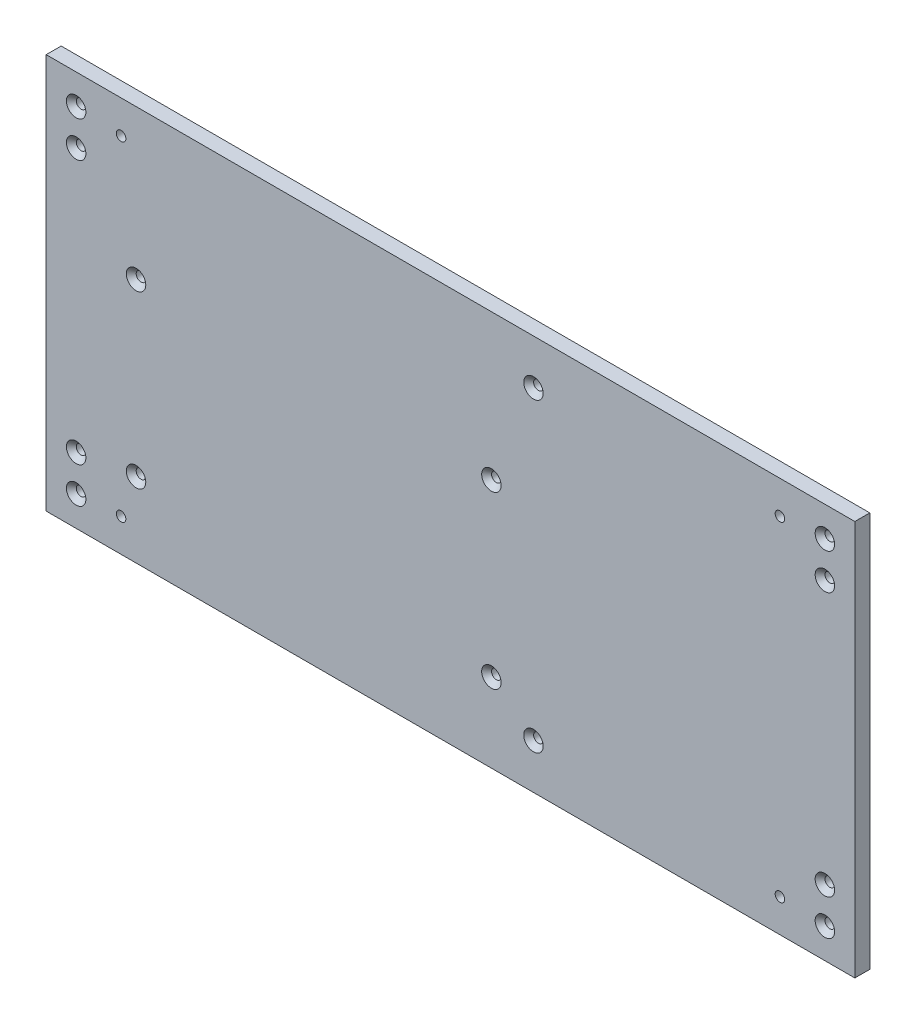
ISO-10303-21;
HEADER;
FILE_DESCRIPTION(('STEP AP214'),'2;1');
FILE_NAME('part.step','',(''),(''),'','','');
FILE_SCHEMA(('AUTOMOTIVE_DESIGN { 1 0 10303 214 1 1 1 1 }'));
ENDSEC;
DATA;
#1=APPLICATION_CONTEXT('core data for automotive mechanical design processes');
#2=APPLICATION_PROTOCOL_DEFINITION('international standard','automotive_design',2000,#1);
#3=PRODUCT_CONTEXT('',#1,'mechanical');
#4=PRODUCT('Part','Part','',(#3));
#5=PRODUCT_RELATED_PRODUCT_CATEGORY('part','',(#4));
#6=PRODUCT_DEFINITION_FORMATION('','',#4);
#7=PRODUCT_DEFINITION_CONTEXT('part definition',#1,'design');
#8=PRODUCT_DEFINITION('design','',#6,#7);
#9=PRODUCT_DEFINITION_SHAPE('','',#8);
#10=(LENGTH_UNIT() NAMED_UNIT(*) SI_UNIT(.MILLI.,.METRE.));
#11=(NAMED_UNIT(*) PLANE_ANGLE_UNIT() SI_UNIT($,.RADIAN.));
#12=(NAMED_UNIT(*) SI_UNIT($,.STERADIAN.) SOLID_ANGLE_UNIT());
#13=UNCERTAINTY_MEASURE_WITH_UNIT(LENGTH_MEASURE(1.E-05),#10,'distance_accuracy_value','');
#14=(GEOMETRIC_REPRESENTATION_CONTEXT(3) GLOBAL_UNCERTAINTY_ASSIGNED_CONTEXT((#13)) GLOBAL_UNIT_ASSIGNED_CONTEXT((#10,
#11,#12)) REPRESENTATION_CONTEXT('',''));
#15=CARTESIAN_POINT('',(0.,0.,0.));
#16=DIRECTION('',(0.,0.,1.));
#17=DIRECTION('',(1.,0.,0.));
#18=AXIS2_PLACEMENT_3D('',#15,#16,#17);
#19=CARTESIAN_POINT('',(-135.,0.,2.5));
#20=DIRECTION('',(-1.,0.,0.));
#21=DIRECTION('',(0.,0.,1.));
#22=AXIS2_PLACEMENT_3D('',#19,#20,#21);
#23=PLANE('',#22);
#24=DIRECTION('',(0.,1.,0.));
#25=VECTOR('',#24,1.);
#26=CARTESIAN_POINT('',(-135.,0.,-2.5));
#27=LINE('',#26,#25);
#28=CARTESIAN_POINT('',(-135.,-66.,-2.5));
#29=VERTEX_POINT('',#28);
#30=CARTESIAN_POINT('',(-135.,66.,-2.5));
#31=VERTEX_POINT('',#30);
#32=EDGE_CURVE('E99',#29,#31,#27,.T.);
#33=ORIENTED_EDGE('',*,*,#32,.F.);
#34=DIRECTION('',(0.,0.,-1.));
#35=VECTOR('',#34,1.);
#36=CARTESIAN_POINT('',(-135.,-66.,2.5));
#37=LINE('',#36,#35);
#38=CARTESIAN_POINT('',(-135.,-66.,2.5));
#39=VERTEX_POINT('',#38);
#40=EDGE_CURVE('E11',#39,#29,#37,.T.);
#41=ORIENTED_EDGE('',*,*,#40,.F.);
#42=DIRECTION('',(0.,1.,0.));
#43=VECTOR('',#42,1.);
#44=CARTESIAN_POINT('',(-135.,0.,2.5));
#45=LINE('',#44,#43);
#46=CARTESIAN_POINT('',(-135.,66.,2.5));
#47=VERTEX_POINT('',#46);
#48=EDGE_CURVE('E92',#39,#47,#45,.T.);
#49=ORIENTED_EDGE('',*,*,#48,.T.);
#50=DIRECTION('',(0.,0.,-1.));
#51=VECTOR('',#50,1.);
#52=CARTESIAN_POINT('',(-135.,66.,2.5));
#53=LINE('',#52,#51);
#54=EDGE_CURVE('E73',#47,#31,#53,.T.);
#55=ORIENTED_EDGE('',*,*,#54,.T.);
#56=EDGE_LOOP('',(#33,#41,#49,#55));
#57=FACE_BOUND('',#56,.T.);
#58=ADVANCED_FACE('F35',(#57),#23,.T.);
#59=CARTESIAN_POINT('',(0.,-66.,2.5));
#60=DIRECTION('',(0.,-1.,0.));
#61=DIRECTION('',(1.,0.,0.));
#62=AXIS2_PLACEMENT_3D('',#59,#60,#61);
#63=PLANE('',#62);
#64=DIRECTION('',(-1.,0.,0.));
#65=VECTOR('',#64,1.);
#66=CARTESIAN_POINT('',(0.,-66.,-2.5));
#67=LINE('',#66,#65);
#68=CARTESIAN_POINT('',(135.,-66.,-2.5));
#69=VERTEX_POINT('',#68);
#70=EDGE_CURVE('E86',#69,#29,#67,.T.);
#71=ORIENTED_EDGE('',*,*,#70,.F.);
#72=DIRECTION('',(0.,0.,-1.));
#73=VECTOR('',#72,1.);
#74=CARTESIAN_POINT('',(135.,-66.,2.5));
#75=LINE('',#74,#73);
#76=CARTESIAN_POINT('',(135.,-66.,2.5));
#77=VERTEX_POINT('',#76);
#78=EDGE_CURVE('E43',#77,#69,#75,.T.);
#79=ORIENTED_EDGE('',*,*,#78,.F.);
#80=DIRECTION('',(-1.,0.,0.));
#81=VECTOR('',#80,1.);
#82=CARTESIAN_POINT('',(0.,-66.,2.5));
#83=LINE('',#82,#81);
#84=EDGE_CURVE('E84',#77,#39,#83,.T.);
#85=ORIENTED_EDGE('',*,*,#84,.T.);
#86=ORIENTED_EDGE('',*,*,#40,.T.);
#87=EDGE_LOOP('',(#71,#79,#85,#86));
#88=FACE_BOUND('',#87,.T.);
#89=ADVANCED_FACE('F82',(#88),#63,.T.);
#90=CARTESIAN_POINT('',(135.,0.,2.5));
#91=DIRECTION('',(-1.,0.,0.));
#92=DIRECTION('',(0.,0.,1.));
#93=AXIS2_PLACEMENT_3D('',#90,#91,#92);
#94=PLANE('',#93);
#95=DIRECTION('',(0.,1.,0.));
#96=VECTOR('',#95,1.);
#97=CARTESIAN_POINT('',(135.,0.,-2.5));
#98=LINE('',#97,#96);
#99=CARTESIAN_POINT('',(135.,66.,-2.5));
#100=VERTEX_POINT('',#99);
#101=EDGE_CURVE('E66',#69,#100,#98,.T.);
#102=ORIENTED_EDGE('',*,*,#101,.T.);
#103=DIRECTION('',(0.,0.,-1.));
#104=VECTOR('',#103,1.);
#105=CARTESIAN_POINT('',(135.,66.,2.5));
#106=LINE('',#105,#104);
#107=CARTESIAN_POINT('',(135.,66.,2.5));
#108=VERTEX_POINT('',#107);
#109=EDGE_CURVE('E87',#108,#100,#106,.T.);
#110=ORIENTED_EDGE('',*,*,#109,.F.);
#111=DIRECTION('',(0.,1.,0.));
#112=VECTOR('',#111,1.);
#113=CARTESIAN_POINT('',(135.,0.,2.5));
#114=LINE('',#113,#112);
#115=EDGE_CURVE('E88',#77,#108,#114,.T.);
#116=ORIENTED_EDGE('',*,*,#115,.F.);
#117=ORIENTED_EDGE('',*,*,#78,.T.);
#118=EDGE_LOOP('',(#102,#110,#116,#117));
#119=FACE_BOUND('',#118,.T.);
#120=ADVANCED_FACE('F89',(#119),#94,.F.);
#121=CARTESIAN_POINT('',(0.,66.,2.5));
#122=DIRECTION('',(0.,-1.,0.));
#123=DIRECTION('',(1.,0.,0.));
#124=AXIS2_PLACEMENT_3D('',#121,#122,#123);
#125=PLANE('',#124);
#126=DIRECTION('',(-1.,0.,0.));
#127=VECTOR('',#126,1.);
#128=CARTESIAN_POINT('',(0.,66.,-2.5));
#129=LINE('',#128,#127);
#130=EDGE_CURVE('E94',#100,#31,#129,.T.);
#131=ORIENTED_EDGE('',*,*,#130,.T.);
#132=ORIENTED_EDGE('',*,*,#54,.F.);
#133=DIRECTION('',(-1.,0.,0.));
#134=VECTOR('',#133,1.);
#135=CARTESIAN_POINT('',(0.,66.,2.5));
#136=LINE('',#135,#134);
#137=EDGE_CURVE('E51',#108,#47,#136,.T.);
#138=ORIENTED_EDGE('',*,*,#137,.F.);
#139=ORIENTED_EDGE('',*,*,#109,.T.);
#140=EDGE_LOOP('',(#131,#132,#138,#139));
#141=FACE_BOUND('',#140,.T.);
#142=ADVANCED_FACE('F109',(#141),#125,.F.);
#143=CARTESIAN_POINT('',(0.,0.,2.5));
#144=DIRECTION('',(0.,0.,1.));
#145=DIRECTION('',(1.,0.,0.));
#146=AXIS2_PLACEMENT_3D('',#143,#144,#145);
#147=PLANE('',#146);
#148=CARTESIAN_POINT('',(13.65,-39.65,2.5));
#149=DIRECTION('',(0.,0.,1.));
#150=DIRECTION('',(1.,0.,0.));
#151=AXIS2_PLACEMENT_3D('',#148,#149,#150);
#152=CIRCLE('',#151,3.25);
#153=CARTESIAN_POINT('',(16.9,-39.65,2.5));
#154=VERTEX_POINT('',#153);
#155=EDGE_CURVE('E264',#154,#154,#152,.T.);
#156=ORIENTED_EDGE('',*,*,#155,.F.);
#157=EDGE_LOOP('',(#156));
#158=FACE_BOUND('',#157,.T.);
#159=CARTESIAN_POINT('',(-105.,16.,2.5));
#160=DIRECTION('',(0.,0.,1.));
#161=DIRECTION('',(1.,0.,0.));
#162=AXIS2_PLACEMENT_3D('',#159,#160,#161);
#163=CIRCLE('',#162,3.25);
#164=CARTESIAN_POINT('',(-101.75,16.,2.5));
#165=VERTEX_POINT('',#164);
#166=EDGE_CURVE('E271',#165,#165,#163,.T.);
#167=ORIENTED_EDGE('',*,*,#166,.F.);
#168=EDGE_LOOP('',(#167));
#169=FACE_BOUND('',#168,.T.);
#170=CARTESIAN_POINT('',(13.65,17.35,2.5));
#171=DIRECTION('',(0.,0.,1.));
#172=DIRECTION('',(1.,0.,0.));
#173=AXIS2_PLACEMENT_3D('',#170,#171,#172);
#174=CIRCLE('',#173,3.25);
#175=CARTESIAN_POINT('',(16.9,17.35,2.5));
#176=VERTEX_POINT('',#175);
#177=EDGE_CURVE('E280',#176,#176,#174,.T.);
#178=ORIENTED_EDGE('',*,*,#177,.F.);
#179=EDGE_LOOP('',(#178));
#180=FACE_BOUND('',#179,.T.);
#181=CARTESIAN_POINT('',(-105.,-41.,2.5));
#182=DIRECTION('',(0.,0.,1.));
#183=DIRECTION('',(1.,0.,0.));
#184=AXIS2_PLACEMENT_3D('',#181,#182,#183);
#185=CIRCLE('',#184,3.25);
#186=CARTESIAN_POINT('',(-101.75,-41.,2.5));
#187=VERTEX_POINT('',#186);
#188=EDGE_CURVE('E289',#187,#187,#185,.T.);
#189=ORIENTED_EDGE('',*,*,#188,.F.);
#190=EDGE_LOOP('',(#189));
#191=FACE_BOUND('',#190,.T.);
#192=CARTESIAN_POINT('',(110.,55.,2.5));
#193=DIRECTION('',(0.,0.,1.));
#194=DIRECTION('',(1.,0.,0.));
#195=AXIS2_PLACEMENT_3D('',#192,#193,#194);
#196=CIRCLE('',#195,1.59999999999999);
#197=CARTESIAN_POINT('',(111.6,55.,2.5));
#198=VERTEX_POINT('',#197);
#199=EDGE_CURVE('E298',#198,#198,#196,.T.);
#200=ORIENTED_EDGE('',*,*,#199,.F.);
#201=EDGE_LOOP('',(#200));
#202=FACE_BOUND('',#201,.T.);
#203=CARTESIAN_POINT('',(-110.,55.,2.5));
#204=DIRECTION('',(0.,0.,1.));
#205=DIRECTION('',(1.,0.,0.));
#206=AXIS2_PLACEMENT_3D('',#203,#204,#205);
#207=CIRCLE('',#206,1.59999999999999);
#208=CARTESIAN_POINT('',(-108.4,55.,2.5));
#209=VERTEX_POINT('',#208);
#210=EDGE_CURVE('E304',#209,#209,#207,.T.);
#211=ORIENTED_EDGE('',*,*,#210,.F.);
#212=EDGE_LOOP('',(#211));
#213=FACE_BOUND('',#212,.T.);
#214=CARTESIAN_POINT('',(-110.,-55.,2.5));
#215=DIRECTION('',(0.,0.,1.));
#216=DIRECTION('',(1.,0.,0.));
#217=AXIS2_PLACEMENT_3D('',#214,#215,#216);
#218=CIRCLE('',#217,1.59999999999999);
#219=CARTESIAN_POINT('',(-108.4,-55.,2.5));
#220=VERTEX_POINT('',#219);
#221=EDGE_CURVE('E310',#220,#220,#218,.T.);
#222=ORIENTED_EDGE('',*,*,#221,.F.);
#223=EDGE_LOOP('',(#222));
#224=FACE_BOUND('',#223,.T.);
#225=CARTESIAN_POINT('',(110.,-55.,2.5));
#226=DIRECTION('',(0.,0.,1.));
#227=DIRECTION('',(1.,0.,0.));
#228=AXIS2_PLACEMENT_3D('',#225,#226,#227);
#229=CIRCLE('',#228,1.59999999999999);
#230=CARTESIAN_POINT('',(111.6,-55.,2.5));
#231=VERTEX_POINT('',#230);
#232=EDGE_CURVE('E316',#231,#231,#229,.T.);
#233=ORIENTED_EDGE('',*,*,#232,.F.);
#234=EDGE_LOOP('',(#233));
#235=FACE_BOUND('',#234,.T.);
#236=CARTESIAN_POINT('',(-125.,56.,2.5));
#237=DIRECTION('',(0.,0.,1.));
#238=DIRECTION('',(1.,0.,0.));
#239=AXIS2_PLACEMENT_3D('',#236,#237,#238);
#240=CIRCLE('',#239,3.25);
#241=CARTESIAN_POINT('',(-121.75,56.,2.5));
#242=VERTEX_POINT('',#241);
#243=EDGE_CURVE('E322',#242,#242,#240,.T.);
#244=ORIENTED_EDGE('',*,*,#243,.F.);
#245=EDGE_LOOP('',(#244));
#246=FACE_BOUND('',#245,.T.);
#247=CARTESIAN_POINT('',(-125.,44.,2.5));
#248=DIRECTION('',(0.,0.,1.));
#249=DIRECTION('',(1.,0.,0.));
#250=AXIS2_PLACEMENT_3D('',#247,#248,#249);
#251=CIRCLE('',#250,3.25);
#252=CARTESIAN_POINT('',(-121.75,44.,2.5));
#253=VERTEX_POINT('',#252);
#254=EDGE_CURVE('E331',#253,#253,#251,.T.);
#255=ORIENTED_EDGE('',*,*,#254,.F.);
#256=EDGE_LOOP('',(#255));
#257=FACE_BOUND('',#256,.T.);
#258=CARTESIAN_POINT('',(-125.,-44.,2.5));
#259=DIRECTION('',(0.,0.,1.));
#260=DIRECTION('',(1.,0.,0.));
#261=AXIS2_PLACEMENT_3D('',#258,#259,#260);
#262=CIRCLE('',#261,3.25);
#263=CARTESIAN_POINT('',(-121.75,-44.,2.5));
#264=VERTEX_POINT('',#263);
#265=EDGE_CURVE('E340',#264,#264,#262,.T.);
#266=ORIENTED_EDGE('',*,*,#265,.F.);
#267=EDGE_LOOP('',(#266));
#268=FACE_BOUND('',#267,.T.);
#269=CARTESIAN_POINT('',(-125.,-56.,2.5));
#270=DIRECTION('',(0.,0.,1.));
#271=DIRECTION('',(1.,0.,0.));
#272=AXIS2_PLACEMENT_3D('',#269,#270,#271);
#273=CIRCLE('',#272,3.25);
#274=CARTESIAN_POINT('',(-121.75,-56.,2.5));
#275=VERTEX_POINT('',#274);
#276=EDGE_CURVE('E349',#275,#275,#273,.T.);
#277=ORIENTED_EDGE('',*,*,#276,.F.);
#278=EDGE_LOOP('',(#277));
#279=FACE_BOUND('',#278,.T.);
#280=CARTESIAN_POINT('',(125.,-56.,2.5));
#281=DIRECTION('',(0.,0.,1.));
#282=DIRECTION('',(1.,0.,0.));
#283=AXIS2_PLACEMENT_3D('',#280,#281,#282);
#284=CIRCLE('',#283,3.25);
#285=CARTESIAN_POINT('',(128.25,-56.,2.5));
#286=VERTEX_POINT('',#285);
#287=EDGE_CURVE('E358',#286,#286,#284,.T.);
#288=ORIENTED_EDGE('',*,*,#287,.F.);
#289=EDGE_LOOP('',(#288));
#290=FACE_BOUND('',#289,.T.);
#291=CARTESIAN_POINT('',(125.,-44.,2.5));
#292=DIRECTION('',(0.,0.,1.));
#293=DIRECTION('',(1.,0.,0.));
#294=AXIS2_PLACEMENT_3D('',#291,#292,#293);
#295=CIRCLE('',#294,3.25);
#296=CARTESIAN_POINT('',(128.25,-44.,2.5));
#297=VERTEX_POINT('',#296);
#298=EDGE_CURVE('E367',#297,#297,#295,.T.);
#299=ORIENTED_EDGE('',*,*,#298,.F.);
#300=EDGE_LOOP('',(#299));
#301=FACE_BOUND('',#300,.T.);
#302=CARTESIAN_POINT('',(125.,44.,2.5));
#303=DIRECTION('',(0.,0.,1.));
#304=DIRECTION('',(1.,0.,0.));
#305=AXIS2_PLACEMENT_3D('',#302,#303,#304);
#306=CIRCLE('',#305,3.25);
#307=CARTESIAN_POINT('',(128.25,44.,2.5));
#308=VERTEX_POINT('',#307);
#309=EDGE_CURVE('E376',#308,#308,#306,.T.);
#310=ORIENTED_EDGE('',*,*,#309,.F.);
#311=EDGE_LOOP('',(#310));
#312=FACE_BOUND('',#311,.T.);
#313=CARTESIAN_POINT('',(125.,56.,2.5));
#314=DIRECTION('',(0.,0.,1.));
#315=DIRECTION('',(1.,0.,0.));
#316=AXIS2_PLACEMENT_3D('',#313,#314,#315);
#317=CIRCLE('',#316,3.25);
#318=CARTESIAN_POINT('',(128.25,56.,2.5));
#319=VERTEX_POINT('',#318);
#320=EDGE_CURVE('E385',#319,#319,#317,.T.);
#321=ORIENTED_EDGE('',*,*,#320,.F.);
#322=EDGE_LOOP('',(#321));
#323=FACE_BOUND('',#322,.T.);
#324=CARTESIAN_POINT('',(27.7,-51.,2.5));
#325=DIRECTION('',(0.,0.,1.));
#326=DIRECTION('',(1.,0.,0.));
#327=AXIS2_PLACEMENT_3D('',#324,#325,#326);
#328=CIRCLE('',#327,3.25);
#329=CARTESIAN_POINT('',(30.95,-51.,2.5));
#330=VERTEX_POINT('',#329);
#331=EDGE_CURVE('E394',#330,#330,#328,.T.);
#332=ORIENTED_EDGE('',*,*,#331,.F.);
#333=EDGE_LOOP('',(#332));
#334=FACE_BOUND('',#333,.T.);
#335=CARTESIAN_POINT('',(27.7,51.,2.5));
#336=DIRECTION('',(0.,0.,1.));
#337=DIRECTION('',(1.,0.,0.));
#338=AXIS2_PLACEMENT_3D('',#335,#336,#337);
#339=CIRCLE('',#338,3.25);
#340=CARTESIAN_POINT('',(30.95,51.,2.5));
#341=VERTEX_POINT('',#340);
#342=EDGE_CURVE('E403',#341,#341,#339,.T.);
#343=ORIENTED_EDGE('',*,*,#342,.F.);
#344=EDGE_LOOP('',(#343));
#345=FACE_BOUND('',#344,.T.);
#346=ORIENTED_EDGE('',*,*,#48,.F.);
#347=ORIENTED_EDGE('',*,*,#84,.F.);
#348=ORIENTED_EDGE('',*,*,#115,.T.);
#349=ORIENTED_EDGE('',*,*,#137,.T.);
#350=EDGE_LOOP('',(#346,#347,#348,#349));
#351=FACE_BOUND('',#350,.T.);
#352=ADVANCED_FACE('F91',(#158,#169,#180,#191,#202,#213,#224,#235,#246,#257,#268,#279,#290,#301,
#312,#323,#334,#345,#351),#147,.T.);
#353=CARTESIAN_POINT('',(0.,0.,-2.5));
#354=DIRECTION('',(0.,0.,1.));
#355=DIRECTION('',(1.,0.,0.));
#356=AXIS2_PLACEMENT_3D('',#353,#354,#355);
#357=PLANE('',#356);
#358=CARTESIAN_POINT('',(13.65,-39.65,-2.5));
#359=DIRECTION('',(0.,0.,1.));
#360=DIRECTION('',(1.,0.,0.));
#361=AXIS2_PLACEMENT_3D('',#358,#359,#360);
#362=CIRCLE('',#361,1.59999999999999);
#363=CARTESIAN_POINT('',(15.25,-39.65,-2.5));
#364=VERTEX_POINT('',#363);
#365=EDGE_CURVE('E266',#364,#364,#362,.T.);
#366=ORIENTED_EDGE('',*,*,#365,.T.);
#367=EDGE_LOOP('',(#366));
#368=FACE_BOUND('',#367,.T.);
#369=CARTESIAN_POINT('',(-105.,16.,-2.5));
#370=DIRECTION('',(0.,0.,1.));
#371=DIRECTION('',(1.,0.,0.));
#372=AXIS2_PLACEMENT_3D('',#369,#370,#371);
#373=CIRCLE('',#372,1.59999999999999);
#374=CARTESIAN_POINT('',(-103.4,16.,-2.5));
#375=VERTEX_POINT('',#374);
#376=EDGE_CURVE('E277',#375,#375,#373,.T.);
#377=ORIENTED_EDGE('',*,*,#376,.T.);
#378=EDGE_LOOP('',(#377));
#379=FACE_BOUND('',#378,.T.);
#380=CARTESIAN_POINT('',(13.65,17.35,-2.5));
#381=DIRECTION('',(0.,0.,1.));
#382=DIRECTION('',(1.,0.,0.));
#383=AXIS2_PLACEMENT_3D('',#380,#381,#382);
#384=CIRCLE('',#383,1.59999999999999);
#385=CARTESIAN_POINT('',(15.25,17.35,-2.5));
#386=VERTEX_POINT('',#385);
#387=EDGE_CURVE('E286',#386,#386,#384,.T.);
#388=ORIENTED_EDGE('',*,*,#387,.T.);
#389=EDGE_LOOP('',(#388));
#390=FACE_BOUND('',#389,.T.);
#391=CARTESIAN_POINT('',(-105.,-41.,-2.5));
#392=DIRECTION('',(0.,0.,1.));
#393=DIRECTION('',(1.,0.,0.));
#394=AXIS2_PLACEMENT_3D('',#391,#392,#393);
#395=CIRCLE('',#394,1.59999999999999);
#396=CARTESIAN_POINT('',(-103.4,-41.,-2.5));
#397=VERTEX_POINT('',#396);
#398=EDGE_CURVE('E295',#397,#397,#395,.T.);
#399=ORIENTED_EDGE('',*,*,#398,.T.);
#400=EDGE_LOOP('',(#399));
#401=FACE_BOUND('',#400,.T.);
#402=CARTESIAN_POINT('',(110.,55.,-2.5));
#403=DIRECTION('',(0.,0.,1.));
#404=DIRECTION('',(1.,0.,0.));
#405=AXIS2_PLACEMENT_3D('',#402,#403,#404);
#406=CIRCLE('',#405,1.59999999999999);
#407=CARTESIAN_POINT('',(111.6,55.,-2.5));
#408=VERTEX_POINT('',#407);
#409=EDGE_CURVE('E301',#408,#408,#406,.T.);
#410=ORIENTED_EDGE('',*,*,#409,.T.);
#411=EDGE_LOOP('',(#410));
#412=FACE_BOUND('',#411,.T.);
#413=CARTESIAN_POINT('',(-110.,55.,-2.5));
#414=DIRECTION('',(0.,0.,1.));
#415=DIRECTION('',(1.,0.,0.));
#416=AXIS2_PLACEMENT_3D('',#413,#414,#415);
#417=CIRCLE('',#416,1.59999999999999);
#418=CARTESIAN_POINT('',(-108.4,55.,-2.5));
#419=VERTEX_POINT('',#418);
#420=EDGE_CURVE('E307',#419,#419,#417,.T.);
#421=ORIENTED_EDGE('',*,*,#420,.T.);
#422=EDGE_LOOP('',(#421));
#423=FACE_BOUND('',#422,.T.);
#424=CARTESIAN_POINT('',(-110.,-55.,-2.5));
#425=DIRECTION('',(0.,0.,1.));
#426=DIRECTION('',(1.,0.,0.));
#427=AXIS2_PLACEMENT_3D('',#424,#425,#426);
#428=CIRCLE('',#427,1.59999999999999);
#429=CARTESIAN_POINT('',(-108.4,-55.,-2.5));
#430=VERTEX_POINT('',#429);
#431=EDGE_CURVE('E313',#430,#430,#428,.T.);
#432=ORIENTED_EDGE('',*,*,#431,.T.);
#433=EDGE_LOOP('',(#432));
#434=FACE_BOUND('',#433,.T.);
#435=CARTESIAN_POINT('',(110.,-55.,-2.5));
#436=DIRECTION('',(0.,0.,1.));
#437=DIRECTION('',(1.,0.,0.));
#438=AXIS2_PLACEMENT_3D('',#435,#436,#437);
#439=CIRCLE('',#438,1.59999999999999);
#440=CARTESIAN_POINT('',(111.6,-55.,-2.5));
#441=VERTEX_POINT('',#440);
#442=EDGE_CURVE('E319',#441,#441,#439,.T.);
#443=ORIENTED_EDGE('',*,*,#442,.T.);
#444=EDGE_LOOP('',(#443));
#445=FACE_BOUND('',#444,.T.);
#446=CARTESIAN_POINT('',(-125.,56.,-2.5));
#447=DIRECTION('',(0.,0.,1.));
#448=DIRECTION('',(1.,0.,0.));
#449=AXIS2_PLACEMENT_3D('',#446,#447,#448);
#450=CIRCLE('',#449,1.59999999999999);
#451=CARTESIAN_POINT('',(-123.4,56.,-2.5));
#452=VERTEX_POINT('',#451);
#453=EDGE_CURVE('E328',#452,#452,#450,.T.);
#454=ORIENTED_EDGE('',*,*,#453,.T.);
#455=EDGE_LOOP('',(#454));
#456=FACE_BOUND('',#455,.T.);
#457=CARTESIAN_POINT('',(-125.,44.,-2.5));
#458=DIRECTION('',(0.,0.,1.));
#459=DIRECTION('',(1.,0.,0.));
#460=AXIS2_PLACEMENT_3D('',#457,#458,#459);
#461=CIRCLE('',#460,1.59999999999999);
#462=CARTESIAN_POINT('',(-123.4,44.,-2.5));
#463=VERTEX_POINT('',#462);
#464=EDGE_CURVE('E337',#463,#463,#461,.T.);
#465=ORIENTED_EDGE('',*,*,#464,.T.);
#466=EDGE_LOOP('',(#465));
#467=FACE_BOUND('',#466,.T.);
#468=CARTESIAN_POINT('',(-125.,-44.,-2.5));
#469=DIRECTION('',(0.,0.,1.));
#470=DIRECTION('',(1.,0.,0.));
#471=AXIS2_PLACEMENT_3D('',#468,#469,#470);
#472=CIRCLE('',#471,1.59999999999999);
#473=CARTESIAN_POINT('',(-123.4,-44.,-2.5));
#474=VERTEX_POINT('',#473);
#475=EDGE_CURVE('E346',#474,#474,#472,.T.);
#476=ORIENTED_EDGE('',*,*,#475,.T.);
#477=EDGE_LOOP('',(#476));
#478=FACE_BOUND('',#477,.T.);
#479=CARTESIAN_POINT('',(-125.,-56.,-2.5));
#480=DIRECTION('',(0.,0.,1.));
#481=DIRECTION('',(1.,0.,0.));
#482=AXIS2_PLACEMENT_3D('',#479,#480,#481);
#483=CIRCLE('',#482,1.59999999999999);
#484=CARTESIAN_POINT('',(-123.4,-56.,-2.5));
#485=VERTEX_POINT('',#484);
#486=EDGE_CURVE('E355',#485,#485,#483,.T.);
#487=ORIENTED_EDGE('',*,*,#486,.T.);
#488=EDGE_LOOP('',(#487));
#489=FACE_BOUND('',#488,.T.);
#490=CARTESIAN_POINT('',(125.,-56.,-2.5));
#491=DIRECTION('',(0.,0.,1.));
#492=DIRECTION('',(1.,0.,0.));
#493=AXIS2_PLACEMENT_3D('',#490,#491,#492);
#494=CIRCLE('',#493,1.59999999999999);
#495=CARTESIAN_POINT('',(126.6,-56.,-2.5));
#496=VERTEX_POINT('',#495);
#497=EDGE_CURVE('E364',#496,#496,#494,.T.);
#498=ORIENTED_EDGE('',*,*,#497,.T.);
#499=EDGE_LOOP('',(#498));
#500=FACE_BOUND('',#499,.T.);
#501=CARTESIAN_POINT('',(125.,-44.,-2.5));
#502=DIRECTION('',(0.,0.,1.));
#503=DIRECTION('',(1.,0.,0.));
#504=AXIS2_PLACEMENT_3D('',#501,#502,#503);
#505=CIRCLE('',#504,1.59999999999999);
#506=CARTESIAN_POINT('',(126.6,-44.,-2.5));
#507=VERTEX_POINT('',#506);
#508=EDGE_CURVE('E373',#507,#507,#505,.T.);
#509=ORIENTED_EDGE('',*,*,#508,.T.);
#510=EDGE_LOOP('',(#509));
#511=FACE_BOUND('',#510,.T.);
#512=CARTESIAN_POINT('',(125.,44.,-2.5));
#513=DIRECTION('',(0.,0.,1.));
#514=DIRECTION('',(1.,0.,0.));
#515=AXIS2_PLACEMENT_3D('',#512,#513,#514);
#516=CIRCLE('',#515,1.59999999999999);
#517=CARTESIAN_POINT('',(126.6,44.,-2.5));
#518=VERTEX_POINT('',#517);
#519=EDGE_CURVE('E382',#518,#518,#516,.T.);
#520=ORIENTED_EDGE('',*,*,#519,.T.);
#521=EDGE_LOOP('',(#520));
#522=FACE_BOUND('',#521,.T.);
#523=CARTESIAN_POINT('',(125.,56.,-2.5));
#524=DIRECTION('',(0.,0.,1.));
#525=DIRECTION('',(1.,0.,0.));
#526=AXIS2_PLACEMENT_3D('',#523,#524,#525);
#527=CIRCLE('',#526,1.59999999999999);
#528=CARTESIAN_POINT('',(126.6,56.,-2.5));
#529=VERTEX_POINT('',#528);
#530=EDGE_CURVE('E391',#529,#529,#527,.T.);
#531=ORIENTED_EDGE('',*,*,#530,.T.);
#532=EDGE_LOOP('',(#531));
#533=FACE_BOUND('',#532,.T.);
#534=CARTESIAN_POINT('',(27.7,-51.,-2.5));
#535=DIRECTION('',(0.,0.,1.));
#536=DIRECTION('',(1.,0.,0.));
#537=AXIS2_PLACEMENT_3D('',#534,#535,#536);
#538=CIRCLE('',#537,1.59999999999999);
#539=CARTESIAN_POINT('',(29.3,-51.,-2.5));
#540=VERTEX_POINT('',#539);
#541=EDGE_CURVE('E400',#540,#540,#538,.T.);
#542=ORIENTED_EDGE('',*,*,#541,.T.);
#543=EDGE_LOOP('',(#542));
#544=FACE_BOUND('',#543,.T.);
#545=CARTESIAN_POINT('',(27.7,51.,-2.5));
#546=DIRECTION('',(0.,0.,1.));
#547=DIRECTION('',(1.,0.,0.));
#548=AXIS2_PLACEMENT_3D('',#545,#546,#547);
#549=CIRCLE('',#548,1.59999999999999);
#550=CARTESIAN_POINT('',(29.3,51.,-2.5));
#551=VERTEX_POINT('',#550);
#552=EDGE_CURVE('E102',#551,#551,#549,.T.);
#553=ORIENTED_EDGE('',*,*,#552,.T.);
#554=EDGE_LOOP('',(#553));
#555=FACE_BOUND('',#554,.T.);
#556=ORIENTED_EDGE('',*,*,#32,.T.);
#557=ORIENTED_EDGE('',*,*,#130,.F.);
#558=ORIENTED_EDGE('',*,*,#101,.F.);
#559=ORIENTED_EDGE('',*,*,#70,.T.);
#560=EDGE_LOOP('',(#556,#557,#558,#559));
#561=FACE_BOUND('',#560,.T.);
#562=ADVANCED_FACE('F111',(#368,#379,#390,#401,#412,#423,#434,#445,#456,#467,#478,#489,#500,
#511,#522,#533,#544,#555,#561),#357,.F.);
#563=CARTESIAN_POINT('',(27.7,51.,2.5));
#564=DIRECTION('',(0.,0.,1.));
#565=DIRECTION('',(1.,0.,0.));
#566=AXIS2_PLACEMENT_3D('',#563,#564,#565);
#567=CYLINDRICAL_SURFACE('',#566,1.59999999999999);
#568=ORIENTED_EDGE('',*,*,#552,.F.);
#569=EDGE_LOOP('',(#568));
#570=FACE_BOUND('',#569,.T.);
#571=CARTESIAN_POINT('',(27.7,51.,0.850000000000001));
#572=DIRECTION('',(0.,0.,1.));
#573=DIRECTION('',(1.,0.,0.));
#574=AXIS2_PLACEMENT_3D('',#571,#572,#573);
#575=CIRCLE('',#574,1.6);
#576=CARTESIAN_POINT('',(29.3,51.,0.850000000000001));
#577=VERTEX_POINT('',#576);
#578=EDGE_CURVE('E406',#577,#577,#575,.T.);
#579=ORIENTED_EDGE('',*,*,#578,.T.);
#580=EDGE_LOOP('',(#579));
#581=FACE_BOUND('',#580,.T.);
#582=ADVANCED_FACE('F125',(#570,#581),#567,.F.);
#583=CARTESIAN_POINT('',(27.7,51.,2.5));
#584=DIRECTION('',(0.,0.,1.));
#585=DIRECTION('',(1.,0.,0.));
#586=AXIS2_PLACEMENT_3D('',#583,#584,#585);
#587=CONICAL_SURFACE('',#586,3.25,0.785398163397448);
#588=ORIENTED_EDGE('',*,*,#578,.F.);
#589=EDGE_LOOP('',(#588));
#590=FACE_BOUND('',#589,.T.);
#591=ORIENTED_EDGE('',*,*,#342,.T.);
#592=EDGE_LOOP('',(#591));
#593=FACE_BOUND('',#592,.T.);
#594=ADVANCED_FACE('F132',(#590,#593),#587,.F.);
#595=CARTESIAN_POINT('',(27.7,-51.,2.5));
#596=DIRECTION('',(0.,0.,1.));
#597=DIRECTION('',(1.,0.,0.));
#598=AXIS2_PLACEMENT_3D('',#595,#596,#597);
#599=CYLINDRICAL_SURFACE('',#598,1.59999999999999);
#600=ORIENTED_EDGE('',*,*,#541,.F.);
#601=EDGE_LOOP('',(#600));
#602=FACE_BOUND('',#601,.T.);
#603=CARTESIAN_POINT('',(27.7,-51.,0.850000000000001));
#604=DIRECTION('',(0.,0.,1.));
#605=DIRECTION('',(1.,0.,0.));
#606=AXIS2_PLACEMENT_3D('',#603,#604,#605);
#607=CIRCLE('',#606,1.6);
#608=CARTESIAN_POINT('',(29.3,-51.,0.850000000000001));
#609=VERTEX_POINT('',#608);
#610=EDGE_CURVE('E397',#609,#609,#607,.T.);
#611=ORIENTED_EDGE('',*,*,#610,.T.);
#612=EDGE_LOOP('',(#611));
#613=FACE_BOUND('',#612,.T.);
#614=ADVANCED_FACE('F136',(#602,#613),#599,.F.);
#615=CARTESIAN_POINT('',(27.7,-51.,2.5));
#616=DIRECTION('',(0.,0.,1.));
#617=DIRECTION('',(1.,0.,0.));
#618=AXIS2_PLACEMENT_3D('',#615,#616,#617);
#619=CONICAL_SURFACE('',#618,3.25,0.785398163397448);
#620=ORIENTED_EDGE('',*,*,#610,.F.);
#621=EDGE_LOOP('',(#620));
#622=FACE_BOUND('',#621,.T.);
#623=ORIENTED_EDGE('',*,*,#331,.T.);
#624=EDGE_LOOP('',(#623));
#625=FACE_BOUND('',#624,.T.);
#626=ADVANCED_FACE('F140',(#622,#625),#619,.F.);
#627=CARTESIAN_POINT('',(125.,56.,2.5));
#628=DIRECTION('',(0.,0.,1.));
#629=DIRECTION('',(1.,0.,0.));
#630=AXIS2_PLACEMENT_3D('',#627,#628,#629);
#631=CYLINDRICAL_SURFACE('',#630,1.59999999999999);
#632=ORIENTED_EDGE('',*,*,#530,.F.);
#633=EDGE_LOOP('',(#632));
#634=FACE_BOUND('',#633,.T.);
#635=CARTESIAN_POINT('',(125.,56.,0.850000000000001));
#636=DIRECTION('',(0.,0.,1.));
#637=DIRECTION('',(1.,0.,0.));
#638=AXIS2_PLACEMENT_3D('',#635,#636,#637);
#639=CIRCLE('',#638,1.59999999999999);
#640=CARTESIAN_POINT('',(126.6,56.,0.850000000000001));
#641=VERTEX_POINT('',#640);
#642=EDGE_CURVE('E388',#641,#641,#639,.T.);
#643=ORIENTED_EDGE('',*,*,#642,.T.);
#644=EDGE_LOOP('',(#643));
#645=FACE_BOUND('',#644,.T.);
#646=ADVANCED_FACE('F144',(#634,#645),#631,.F.);
#647=CARTESIAN_POINT('',(125.,56.,2.5));
#648=DIRECTION('',(0.,0.,1.));
#649=DIRECTION('',(1.,0.,0.));
#650=AXIS2_PLACEMENT_3D('',#647,#648,#649);
#651=CONICAL_SURFACE('',#650,3.25,0.785398163397452);
#652=ORIENTED_EDGE('',*,*,#642,.F.);
#653=EDGE_LOOP('',(#652));
#654=FACE_BOUND('',#653,.T.);
#655=ORIENTED_EDGE('',*,*,#320,.T.);
#656=EDGE_LOOP('',(#655));
#657=FACE_BOUND('',#656,.T.);
#658=ADVANCED_FACE('F148',(#654,#657),#651,.F.);
#659=CARTESIAN_POINT('',(125.,44.,2.5));
#660=DIRECTION('',(0.,0.,1.));
#661=DIRECTION('',(1.,0.,0.));
#662=AXIS2_PLACEMENT_3D('',#659,#660,#661);
#663=CYLINDRICAL_SURFACE('',#662,1.59999999999999);
#664=ORIENTED_EDGE('',*,*,#519,.F.);
#665=EDGE_LOOP('',(#664));
#666=FACE_BOUND('',#665,.T.);
#667=CARTESIAN_POINT('',(125.,44.,0.850000000000001));
#668=DIRECTION('',(0.,0.,1.));
#669=DIRECTION('',(1.,0.,0.));
#670=AXIS2_PLACEMENT_3D('',#667,#668,#669);
#671=CIRCLE('',#670,1.59999999999999);
#672=CARTESIAN_POINT('',(126.6,44.,0.850000000000001));
#673=VERTEX_POINT('',#672);
#674=EDGE_CURVE('E379',#673,#673,#671,.T.);
#675=ORIENTED_EDGE('',*,*,#674,.T.);
#676=EDGE_LOOP('',(#675));
#677=FACE_BOUND('',#676,.T.);
#678=ADVANCED_FACE('F152',(#666,#677),#663,.F.);
#679=CARTESIAN_POINT('',(125.,44.,2.5));
#680=DIRECTION('',(0.,0.,1.));
#681=DIRECTION('',(1.,0.,0.));
#682=AXIS2_PLACEMENT_3D('',#679,#680,#681);
#683=CONICAL_SURFACE('',#682,3.25,0.785398163397452);
#684=ORIENTED_EDGE('',*,*,#674,.F.);
#685=EDGE_LOOP('',(#684));
#686=FACE_BOUND('',#685,.T.);
#687=ORIENTED_EDGE('',*,*,#309,.T.);
#688=EDGE_LOOP('',(#687));
#689=FACE_BOUND('',#688,.T.);
#690=ADVANCED_FACE('F156',(#686,#689),#683,.F.);
#691=CARTESIAN_POINT('',(125.,-44.,2.5));
#692=DIRECTION('',(0.,0.,1.));
#693=DIRECTION('',(1.,0.,0.));
#694=AXIS2_PLACEMENT_3D('',#691,#692,#693);
#695=CYLINDRICAL_SURFACE('',#694,1.59999999999999);
#696=ORIENTED_EDGE('',*,*,#508,.F.);
#697=EDGE_LOOP('',(#696));
#698=FACE_BOUND('',#697,.T.);
#699=CARTESIAN_POINT('',(125.,-44.,0.850000000000001));
#700=DIRECTION('',(0.,0.,1.));
#701=DIRECTION('',(1.,0.,0.));
#702=AXIS2_PLACEMENT_3D('',#699,#700,#701);
#703=CIRCLE('',#702,1.59999999999999);
#704=CARTESIAN_POINT('',(126.6,-44.,0.850000000000001));
#705=VERTEX_POINT('',#704);
#706=EDGE_CURVE('E370',#705,#705,#703,.T.);
#707=ORIENTED_EDGE('',*,*,#706,.T.);
#708=EDGE_LOOP('',(#707));
#709=FACE_BOUND('',#708,.T.);
#710=ADVANCED_FACE('F160',(#698,#709),#695,.F.);
#711=CARTESIAN_POINT('',(125.,-44.,2.5));
#712=DIRECTION('',(0.,0.,1.));
#713=DIRECTION('',(1.,0.,0.));
#714=AXIS2_PLACEMENT_3D('',#711,#712,#713);
#715=CONICAL_SURFACE('',#714,3.25,0.785398163397452);
#716=ORIENTED_EDGE('',*,*,#706,.F.);
#717=EDGE_LOOP('',(#716));
#718=FACE_BOUND('',#717,.T.);
#719=ORIENTED_EDGE('',*,*,#298,.T.);
#720=EDGE_LOOP('',(#719));
#721=FACE_BOUND('',#720,.T.);
#722=ADVANCED_FACE('F164',(#718,#721),#715,.F.);
#723=CARTESIAN_POINT('',(125.,-56.,2.5));
#724=DIRECTION('',(0.,0.,1.));
#725=DIRECTION('',(1.,0.,0.));
#726=AXIS2_PLACEMENT_3D('',#723,#724,#725);
#727=CYLINDRICAL_SURFACE('',#726,1.59999999999999);
#728=ORIENTED_EDGE('',*,*,#497,.F.);
#729=EDGE_LOOP('',(#728));
#730=FACE_BOUND('',#729,.T.);
#731=CARTESIAN_POINT('',(125.,-56.,0.850000000000001));
#732=DIRECTION('',(0.,0.,1.));
#733=DIRECTION('',(1.,0.,0.));
#734=AXIS2_PLACEMENT_3D('',#731,#732,#733);
#735=CIRCLE('',#734,1.59999999999999);
#736=CARTESIAN_POINT('',(126.6,-56.,0.850000000000001));
#737=VERTEX_POINT('',#736);
#738=EDGE_CURVE('E361',#737,#737,#735,.T.);
#739=ORIENTED_EDGE('',*,*,#738,.T.);
#740=EDGE_LOOP('',(#739));
#741=FACE_BOUND('',#740,.T.);
#742=ADVANCED_FACE('F168',(#730,#741),#727,.F.);
#743=CARTESIAN_POINT('',(125.,-56.,2.5));
#744=DIRECTION('',(0.,0.,1.));
#745=DIRECTION('',(1.,0.,0.));
#746=AXIS2_PLACEMENT_3D('',#743,#744,#745);
#747=CONICAL_SURFACE('',#746,3.25,0.785398163397452);
#748=ORIENTED_EDGE('',*,*,#738,.F.);
#749=EDGE_LOOP('',(#748));
#750=FACE_BOUND('',#749,.T.);
#751=ORIENTED_EDGE('',*,*,#287,.T.);
#752=EDGE_LOOP('',(#751));
#753=FACE_BOUND('',#752,.T.);
#754=ADVANCED_FACE('F172',(#750,#753),#747,.F.);
#755=CARTESIAN_POINT('',(-125.,-56.,2.5));
#756=DIRECTION('',(0.,0.,1.));
#757=DIRECTION('',(1.,0.,0.));
#758=AXIS2_PLACEMENT_3D('',#755,#756,#757);
#759=CYLINDRICAL_SURFACE('',#758,1.6);
#760=ORIENTED_EDGE('',*,*,#486,.F.);
#761=EDGE_LOOP('',(#760));
#762=FACE_BOUND('',#761,.T.);
#763=CARTESIAN_POINT('',(-125.,-56.,0.850000000000001));
#764=DIRECTION('',(0.,0.,1.));
#765=DIRECTION('',(1.,0.,0.));
#766=AXIS2_PLACEMENT_3D('',#763,#764,#765);
#767=CIRCLE('',#766,1.6);
#768=CARTESIAN_POINT('',(-123.4,-56.,0.850000000000001));
#769=VERTEX_POINT('',#768);
#770=EDGE_CURVE('E352',#769,#769,#767,.T.);
#771=ORIENTED_EDGE('',*,*,#770,.T.);
#772=EDGE_LOOP('',(#771));
#773=FACE_BOUND('',#772,.T.);
#774=ADVANCED_FACE('F176',(#762,#773),#759,.F.);
#775=CARTESIAN_POINT('',(-125.,-56.,2.5));
#776=DIRECTION('',(0.,0.,1.));
#777=DIRECTION('',(1.,0.,0.));
#778=AXIS2_PLACEMENT_3D('',#775,#776,#777);
#779=CONICAL_SURFACE('',#778,3.25,0.785398163397448);
#780=ORIENTED_EDGE('',*,*,#770,.F.);
#781=EDGE_LOOP('',(#780));
#782=FACE_BOUND('',#781,.T.);
#783=ORIENTED_EDGE('',*,*,#276,.T.);
#784=EDGE_LOOP('',(#783));
#785=FACE_BOUND('',#784,.T.);
#786=ADVANCED_FACE('F180',(#782,#785),#779,.F.);
#787=CARTESIAN_POINT('',(-125.,-44.,2.5));
#788=DIRECTION('',(0.,0.,1.));
#789=DIRECTION('',(1.,0.,0.));
#790=AXIS2_PLACEMENT_3D('',#787,#788,#789);
#791=CYLINDRICAL_SURFACE('',#790,1.6);
#792=ORIENTED_EDGE('',*,*,#475,.F.);
#793=EDGE_LOOP('',(#792));
#794=FACE_BOUND('',#793,.T.);
#795=CARTESIAN_POINT('',(-125.,-44.,0.850000000000001));
#796=DIRECTION('',(0.,0.,1.));
#797=DIRECTION('',(1.,0.,0.));
#798=AXIS2_PLACEMENT_3D('',#795,#796,#797);
#799=CIRCLE('',#798,1.6);
#800=CARTESIAN_POINT('',(-123.4,-44.,0.850000000000001));
#801=VERTEX_POINT('',#800);
#802=EDGE_CURVE('E343',#801,#801,#799,.T.);
#803=ORIENTED_EDGE('',*,*,#802,.T.);
#804=EDGE_LOOP('',(#803));
#805=FACE_BOUND('',#804,.T.);
#806=ADVANCED_FACE('F184',(#794,#805),#791,.F.);
#807=CARTESIAN_POINT('',(-125.,-44.,2.5));
#808=DIRECTION('',(0.,0.,1.));
#809=DIRECTION('',(1.,0.,0.));
#810=AXIS2_PLACEMENT_3D('',#807,#808,#809);
#811=CONICAL_SURFACE('',#810,3.25,0.785398163397448);
#812=ORIENTED_EDGE('',*,*,#802,.F.);
#813=EDGE_LOOP('',(#812));
#814=FACE_BOUND('',#813,.T.);
#815=ORIENTED_EDGE('',*,*,#265,.T.);
#816=EDGE_LOOP('',(#815));
#817=FACE_BOUND('',#816,.T.);
#818=ADVANCED_FACE('F188',(#814,#817),#811,.F.);
#819=CARTESIAN_POINT('',(-125.,44.,2.5));
#820=DIRECTION('',(0.,0.,1.));
#821=DIRECTION('',(1.,0.,0.));
#822=AXIS2_PLACEMENT_3D('',#819,#820,#821);
#823=CYLINDRICAL_SURFACE('',#822,1.6);
#824=ORIENTED_EDGE('',*,*,#464,.F.);
#825=EDGE_LOOP('',(#824));
#826=FACE_BOUND('',#825,.T.);
#827=CARTESIAN_POINT('',(-125.,44.,0.850000000000001));
#828=DIRECTION('',(0.,0.,1.));
#829=DIRECTION('',(1.,0.,0.));
#830=AXIS2_PLACEMENT_3D('',#827,#828,#829);
#831=CIRCLE('',#830,1.6);
#832=CARTESIAN_POINT('',(-123.4,44.,0.850000000000001));
#833=VERTEX_POINT('',#832);
#834=EDGE_CURVE('E334',#833,#833,#831,.T.);
#835=ORIENTED_EDGE('',*,*,#834,.T.);
#836=EDGE_LOOP('',(#835));
#837=FACE_BOUND('',#836,.T.);
#838=ADVANCED_FACE('F192',(#826,#837),#823,.F.);
#839=CARTESIAN_POINT('',(-125.,44.,2.5));
#840=DIRECTION('',(0.,0.,1.));
#841=DIRECTION('',(1.,0.,0.));
#842=AXIS2_PLACEMENT_3D('',#839,#840,#841);
#843=CONICAL_SURFACE('',#842,3.25,0.785398163397448);
#844=ORIENTED_EDGE('',*,*,#834,.F.);
#845=EDGE_LOOP('',(#844));
#846=FACE_BOUND('',#845,.T.);
#847=ORIENTED_EDGE('',*,*,#254,.T.);
#848=EDGE_LOOP('',(#847));
#849=FACE_BOUND('',#848,.T.);
#850=ADVANCED_FACE('F196',(#846,#849),#843,.F.);
#851=CARTESIAN_POINT('',(-125.,56.,2.5));
#852=DIRECTION('',(0.,0.,1.));
#853=DIRECTION('',(1.,0.,0.));
#854=AXIS2_PLACEMENT_3D('',#851,#852,#853);
#855=CYLINDRICAL_SURFACE('',#854,1.6);
#856=ORIENTED_EDGE('',*,*,#453,.F.);
#857=EDGE_LOOP('',(#856));
#858=FACE_BOUND('',#857,.T.);
#859=CARTESIAN_POINT('',(-125.,56.,0.850000000000001));
#860=DIRECTION('',(0.,0.,1.));
#861=DIRECTION('',(1.,0.,0.));
#862=AXIS2_PLACEMENT_3D('',#859,#860,#861);
#863=CIRCLE('',#862,1.6);
#864=CARTESIAN_POINT('',(-123.4,56.,0.850000000000001));
#865=VERTEX_POINT('',#864);
#866=EDGE_CURVE('E325',#865,#865,#863,.T.);
#867=ORIENTED_EDGE('',*,*,#866,.T.);
#868=EDGE_LOOP('',(#867));
#869=FACE_BOUND('',#868,.T.);
#870=ADVANCED_FACE('F200',(#858,#869),#855,.F.);
#871=CARTESIAN_POINT('',(-125.,56.,2.5));
#872=DIRECTION('',(0.,0.,1.));
#873=DIRECTION('',(1.,0.,0.));
#874=AXIS2_PLACEMENT_3D('',#871,#872,#873);
#875=CONICAL_SURFACE('',#874,3.25,0.785398163397448);
#876=ORIENTED_EDGE('',*,*,#866,.F.);
#877=EDGE_LOOP('',(#876));
#878=FACE_BOUND('',#877,.T.);
#879=ORIENTED_EDGE('',*,*,#243,.T.);
#880=EDGE_LOOP('',(#879));
#881=FACE_BOUND('',#880,.T.);
#882=ADVANCED_FACE('F204',(#878,#881),#875,.F.);
#883=CARTESIAN_POINT('',(110.,-55.,2.5));
#884=DIRECTION('',(0.,0.,1.));
#885=DIRECTION('',(1.,0.,0.));
#886=AXIS2_PLACEMENT_3D('',#883,#884,#885);
#887=CYLINDRICAL_SURFACE('',#886,1.59999999999999);
#888=ORIENTED_EDGE('',*,*,#442,.F.);
#889=EDGE_LOOP('',(#888));
#890=FACE_BOUND('',#889,.T.);
#891=ORIENTED_EDGE('',*,*,#232,.T.);
#892=EDGE_LOOP('',(#891));
#893=FACE_BOUND('',#892,.T.);
#894=ADVANCED_FACE('F208',(#890,#893),#887,.F.);
#895=CARTESIAN_POINT('',(-110.,-55.,2.5));
#896=DIRECTION('',(0.,0.,1.));
#897=DIRECTION('',(1.,0.,0.));
#898=AXIS2_PLACEMENT_3D('',#895,#896,#897);
#899=CYLINDRICAL_SURFACE('',#898,1.59999999999999);
#900=ORIENTED_EDGE('',*,*,#431,.F.);
#901=EDGE_LOOP('',(#900));
#902=FACE_BOUND('',#901,.T.);
#903=ORIENTED_EDGE('',*,*,#221,.T.);
#904=EDGE_LOOP('',(#903));
#905=FACE_BOUND('',#904,.T.);
#906=ADVANCED_FACE('F212',(#902,#905),#899,.F.);
#907=CARTESIAN_POINT('',(-110.,55.,2.5));
#908=DIRECTION('',(0.,0.,1.));
#909=DIRECTION('',(1.,0.,0.));
#910=AXIS2_PLACEMENT_3D('',#907,#908,#909);
#911=CYLINDRICAL_SURFACE('',#910,1.59999999999999);
#912=ORIENTED_EDGE('',*,*,#420,.F.);
#913=EDGE_LOOP('',(#912));
#914=FACE_BOUND('',#913,.T.);
#915=ORIENTED_EDGE('',*,*,#210,.T.);
#916=EDGE_LOOP('',(#915));
#917=FACE_BOUND('',#916,.T.);
#918=ADVANCED_FACE('F216',(#914,#917),#911,.F.);
#919=CARTESIAN_POINT('',(110.,55.,2.5));
#920=DIRECTION('',(0.,0.,1.));
#921=DIRECTION('',(1.,0.,0.));
#922=AXIS2_PLACEMENT_3D('',#919,#920,#921);
#923=CYLINDRICAL_SURFACE('',#922,1.59999999999999);
#924=ORIENTED_EDGE('',*,*,#409,.F.);
#925=EDGE_LOOP('',(#924));
#926=FACE_BOUND('',#925,.T.);
#927=ORIENTED_EDGE('',*,*,#199,.T.);
#928=EDGE_LOOP('',(#927));
#929=FACE_BOUND('',#928,.T.);
#930=ADVANCED_FACE('F220',(#926,#929),#923,.F.);
#931=CARTESIAN_POINT('',(-105.,-41.,2.5));
#932=DIRECTION('',(0.,0.,1.));
#933=DIRECTION('',(1.,0.,0.));
#934=AXIS2_PLACEMENT_3D('',#931,#932,#933);
#935=CYLINDRICAL_SURFACE('',#934,1.6);
#936=ORIENTED_EDGE('',*,*,#398,.F.);
#937=EDGE_LOOP('',(#936));
#938=FACE_BOUND('',#937,.T.);
#939=CARTESIAN_POINT('',(-105.,-41.,0.850000000000001));
#940=DIRECTION('',(0.,0.,1.));
#941=DIRECTION('',(1.,0.,0.));
#942=AXIS2_PLACEMENT_3D('',#939,#940,#941);
#943=CIRCLE('',#942,1.6);
#944=CARTESIAN_POINT('',(-103.4,-41.,0.850000000000001));
#945=VERTEX_POINT('',#944);
#946=EDGE_CURVE('E292',#945,#945,#943,.T.);
#947=ORIENTED_EDGE('',*,*,#946,.T.);
#948=EDGE_LOOP('',(#947));
#949=FACE_BOUND('',#948,.T.);
#950=ADVANCED_FACE('F224',(#938,#949),#935,.F.);
#951=CARTESIAN_POINT('',(-105.,-41.,2.5));
#952=DIRECTION('',(0.,0.,1.));
#953=DIRECTION('',(1.,0.,0.));
#954=AXIS2_PLACEMENT_3D('',#951,#952,#953);
#955=CONICAL_SURFACE('',#954,3.25,0.785398163397448);
#956=ORIENTED_EDGE('',*,*,#946,.F.);
#957=EDGE_LOOP('',(#956));
#958=FACE_BOUND('',#957,.T.);
#959=ORIENTED_EDGE('',*,*,#188,.T.);
#960=EDGE_LOOP('',(#959));
#961=FACE_BOUND('',#960,.T.);
#962=ADVANCED_FACE('F228',(#958,#961),#955,.F.);
#963=CARTESIAN_POINT('',(13.65,17.35,2.5));
#964=DIRECTION('',(0.,0.,1.));
#965=DIRECTION('',(1.,0.,0.));
#966=AXIS2_PLACEMENT_3D('',#963,#964,#965);
#967=CYLINDRICAL_SURFACE('',#966,1.59999999999999);
#968=ORIENTED_EDGE('',*,*,#387,.F.);
#969=EDGE_LOOP('',(#968));
#970=FACE_BOUND('',#969,.T.);
#971=CARTESIAN_POINT('',(13.65,17.35,0.850000000000001));
#972=DIRECTION('',(0.,0.,1.));
#973=DIRECTION('',(1.,0.,0.));
#974=AXIS2_PLACEMENT_3D('',#971,#972,#973);
#975=CIRCLE('',#974,1.6);
#976=CARTESIAN_POINT('',(15.25,17.35,0.850000000000001));
#977=VERTEX_POINT('',#976);
#978=EDGE_CURVE('E283',#977,#977,#975,.T.);
#979=ORIENTED_EDGE('',*,*,#978,.T.);
#980=EDGE_LOOP('',(#979));
#981=FACE_BOUND('',#980,.T.);
#982=ADVANCED_FACE('F232',(#970,#981),#967,.F.);
#983=CARTESIAN_POINT('',(13.65,17.35,2.5));
#984=DIRECTION('',(0.,0.,1.));
#985=DIRECTION('',(1.,0.,0.));
#986=AXIS2_PLACEMENT_3D('',#983,#984,#985);
#987=CONICAL_SURFACE('',#986,3.25,0.785398163397449);
#988=ORIENTED_EDGE('',*,*,#978,.F.);
#989=EDGE_LOOP('',(#988));
#990=FACE_BOUND('',#989,.T.);
#991=ORIENTED_EDGE('',*,*,#177,.T.);
#992=EDGE_LOOP('',(#991));
#993=FACE_BOUND('',#992,.T.);
#994=ADVANCED_FACE('F236',(#990,#993),#987,.F.);
#995=CARTESIAN_POINT('',(-105.,16.,2.5));
#996=DIRECTION('',(0.,0.,1.));
#997=DIRECTION('',(1.,0.,0.));
#998=AXIS2_PLACEMENT_3D('',#995,#996,#997);
#999=CYLINDRICAL_SURFACE('',#998,1.6);
#1000=ORIENTED_EDGE('',*,*,#376,.F.);
#1001=EDGE_LOOP('',(#1000));
#1002=FACE_BOUND('',#1001,.T.);
#1003=CARTESIAN_POINT('',(-105.,16.,0.850000000000001));
#1004=DIRECTION('',(0.,0.,1.));
#1005=DIRECTION('',(1.,0.,0.));
#1006=AXIS2_PLACEMENT_3D('',#1003,#1004,#1005);
#1007=CIRCLE('',#1006,1.6);
#1008=CARTESIAN_POINT('',(-103.4,16.,0.850000000000001));
#1009=VERTEX_POINT('',#1008);
#1010=EDGE_CURVE('E274',#1009,#1009,#1007,.T.);
#1011=ORIENTED_EDGE('',*,*,#1010,.T.);
#1012=EDGE_LOOP('',(#1011));
#1013=FACE_BOUND('',#1012,.T.);
#1014=ADVANCED_FACE('F240',(#1002,#1013),#999,.F.);
#1015=CARTESIAN_POINT('',(-105.,16.,2.5));
#1016=DIRECTION('',(0.,0.,1.));
#1017=DIRECTION('',(1.,0.,0.));
#1018=AXIS2_PLACEMENT_3D('',#1015,#1016,#1017);
#1019=CONICAL_SURFACE('',#1018,3.25,0.785398163397448);
#1020=ORIENTED_EDGE('',*,*,#1010,.F.);
#1021=EDGE_LOOP('',(#1020));
#1022=FACE_BOUND('',#1021,.T.);
#1023=ORIENTED_EDGE('',*,*,#166,.T.);
#1024=EDGE_LOOP('',(#1023));
#1025=FACE_BOUND('',#1024,.T.);
#1026=ADVANCED_FACE('F244',(#1022,#1025),#1019,.F.);
#1027=CARTESIAN_POINT('',(13.65,-39.65,2.5));
#1028=DIRECTION('',(0.,0.,1.));
#1029=DIRECTION('',(1.,0.,0.));
#1030=AXIS2_PLACEMENT_3D('',#1027,#1028,#1029);
#1031=CYLINDRICAL_SURFACE('',#1030,1.59999999999999);
#1032=ORIENTED_EDGE('',*,*,#365,.F.);
#1033=EDGE_LOOP('',(#1032));
#1034=FACE_BOUND('',#1033,.T.);
#1035=CARTESIAN_POINT('',(13.65,-39.65,0.850000000000001));
#1036=DIRECTION('',(0.,0.,1.));
#1037=DIRECTION('',(1.,0.,0.));
#1038=AXIS2_PLACEMENT_3D('',#1035,#1036,#1037);
#1039=CIRCLE('',#1038,1.6);
#1040=CARTESIAN_POINT('',(15.25,-39.65,0.850000000000001));
#1041=VERTEX_POINT('',#1040);
#1042=EDGE_CURVE('E261',#1041,#1041,#1039,.T.);
#1043=ORIENTED_EDGE('',*,*,#1042,.T.);
#1044=EDGE_LOOP('',(#1043));
#1045=FACE_BOUND('',#1044,.T.);
#1046=ADVANCED_FACE('F248',(#1034,#1045),#1031,.F.);
#1047=CARTESIAN_POINT('',(13.65,-39.65,2.5));
#1048=DIRECTION('',(0.,0.,1.));
#1049=DIRECTION('',(1.,0.,0.));
#1050=AXIS2_PLACEMENT_3D('',#1047,#1048,#1049);
#1051=CONICAL_SURFACE('',#1050,3.25,0.785398163397449);
#1052=ORIENTED_EDGE('',*,*,#1042,.F.);
#1053=EDGE_LOOP('',(#1052));
#1054=FACE_BOUND('',#1053,.T.);
#1055=ORIENTED_EDGE('',*,*,#155,.T.);
#1056=EDGE_LOOP('',(#1055));
#1057=FACE_BOUND('',#1056,.T.);
#1058=ADVANCED_FACE('F252',(#1054,#1057),#1051,.F.);
#1059=CLOSED_SHELL('',(#58,#89,#120,#142,#352,#562,#582,#594,#614,#626,#646,#658,#678,#690,#710,
#722,#742,#754,#774,#786,#806,#818,#838,#850,#870,#882,#894,#906,#918,#930,#950,#962,#982,#994,
#1014,#1026,#1046,#1058));
#1060=MANIFOLD_SOLID_BREP('B2',#1059);
#1061=ADVANCED_BREP_SHAPE_REPRESENTATION('',(#18,#1060),#14);
#1062=SHAPE_DEFINITION_REPRESENTATION(#9,#1061);
ENDSEC;
END-ISO-10303-21;
